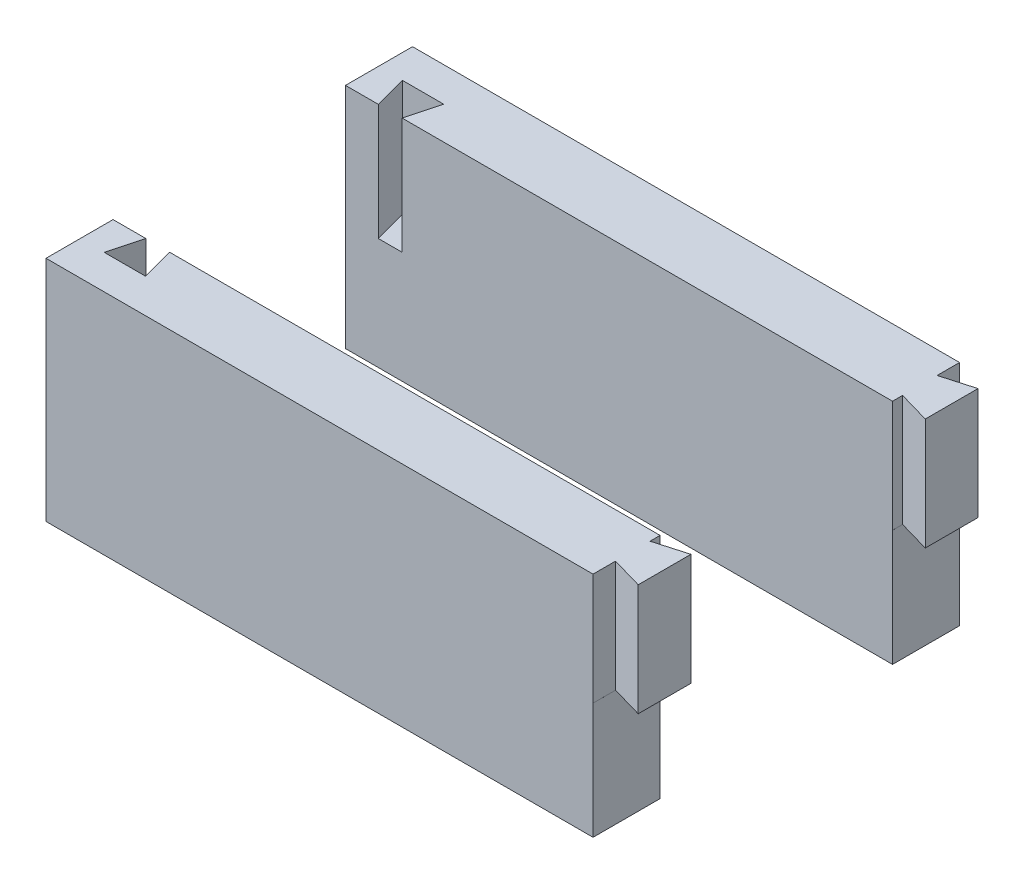
ISO-10303-21;
HEADER;
FILE_DESCRIPTION(('STEP AP214'),'2;1');
FILE_NAME('part.step','',(''),(''),'','','');
FILE_SCHEMA(('AUTOMOTIVE_DESIGN { 1 0 10303 214 1 1 1 1 }'));
ENDSEC;
DATA;
#1=APPLICATION_CONTEXT('core data for automotive mechanical design processes');
#2=APPLICATION_PROTOCOL_DEFINITION('international standard','automotive_design',2000,#1);
#3=PRODUCT_CONTEXT('',#1,'mechanical');
#4=PRODUCT('Part','Part','',(#3));
#5=PRODUCT_RELATED_PRODUCT_CATEGORY('part','',(#4));
#6=PRODUCT_DEFINITION_FORMATION('','',#4);
#7=PRODUCT_DEFINITION_CONTEXT('part definition',#1,'design');
#8=PRODUCT_DEFINITION('design','',#6,#7);
#9=PRODUCT_DEFINITION_SHAPE('','',#8);
#10=(LENGTH_UNIT() NAMED_UNIT(*) SI_UNIT(.MILLI.,.METRE.));
#11=(NAMED_UNIT(*) PLANE_ANGLE_UNIT() SI_UNIT($,.RADIAN.));
#12=(NAMED_UNIT(*) SI_UNIT($,.STERADIAN.) SOLID_ANGLE_UNIT());
#13=UNCERTAINTY_MEASURE_WITH_UNIT(LENGTH_MEASURE(1.E-05),#10,'distance_accuracy_value','');
#14=(GEOMETRIC_REPRESENTATION_CONTEXT(3) GLOBAL_UNCERTAINTY_ASSIGNED_CONTEXT((#13)) GLOBAL_UNIT_ASSIGNED_CONTEXT((#10,
#11,#12)) REPRESENTATION_CONTEXT('',''));
#15=CARTESIAN_POINT('',(0.,0.,0.));
#16=DIRECTION('',(0.,0.,1.));
#17=DIRECTION('',(1.,0.,0.));
#18=AXIS2_PLACEMENT_3D('',#15,#16,#17);
#19=CARTESIAN_POINT('',(-60.9366197183099,28.612676056338,-67.));
#20=DIRECTION('',(1.,0.,0.));
#21=DIRECTION('',(0.,0.,1.));
#22=AXIS2_PLACEMENT_3D('',#19,#20,#21);
#23=PLANE('',#22);
#24=DIRECTION('',(0.,-1.,0.));
#25=VECTOR('',#24,1.);
#26=CARTESIAN_POINT('',(-60.9366197183099,28.612676056338,-52.));
#27=LINE('',#26,#25);
#28=CARTESIAN_POINT('',(-60.9366197183099,28.612676056338,-52.));
#29=VERTEX_POINT('',#28);
#30=CARTESIAN_POINT('',(-60.9366197183099,-22.387323943662,-52.));
#31=VERTEX_POINT('',#30);
#32=EDGE_CURVE('E285',#29,#31,#27,.T.);
#33=ORIENTED_EDGE('',*,*,#32,.F.);
#34=DIRECTION('',(0.,0.,1.));
#35=VECTOR('',#34,1.);
#36=CARTESIAN_POINT('',(-60.9366197183099,28.612676056338,-67.));
#37=LINE('',#36,#35);
#38=CARTESIAN_POINT('',(-60.9366197183099,28.612676056338,-67.));
#39=VERTEX_POINT('',#38);
#40=EDGE_CURVE('E301',#39,#29,#37,.T.);
#41=ORIENTED_EDGE('',*,*,#40,.F.);
#42=DIRECTION('',(0.,-1.,0.));
#43=VECTOR('',#42,1.);
#44=CARTESIAN_POINT('',(-60.9366197183099,28.612676056338,-67.));
#45=LINE('',#44,#43);
#46=CARTESIAN_POINT('',(-60.9366197183099,-22.387323943662,-67.));
#47=VERTEX_POINT('',#46);
#48=EDGE_CURVE('E289',#39,#47,#45,.T.);
#49=ORIENTED_EDGE('',*,*,#48,.T.);
#50=DIRECTION('',(0.,0.,1.));
#51=VECTOR('',#50,1.);
#52=CARTESIAN_POINT('',(-60.9366197183099,-22.387323943662,-67.));
#53=LINE('',#52,#51);
#54=EDGE_CURVE('E12',#47,#31,#53,.T.);
#55=ORIENTED_EDGE('',*,*,#54,.T.);
#56=EDGE_LOOP('',(#33,#41,#49,#55));
#57=FACE_BOUND('',#56,.T.);
#58=ADVANCED_FACE('F56',(#57),#23,.F.);
#59=CARTESIAN_POINT('',(-60.9366197183099,-22.387323943662,-67.));
#60=DIRECTION('',(0.,1.,0.));
#61=DIRECTION('',(0.,0.,-1.));
#62=AXIS2_PLACEMENT_3D('',#59,#60,#61);
#63=PLANE('',#62);
#64=DIRECTION('',(1.,0.,0.));
#65=VECTOR('',#64,1.);
#66=CARTESIAN_POINT('',(-60.9366197183099,-22.387323943662,-52.));
#67=LINE('',#66,#65);
#68=CARTESIAN_POINT('',(61.4533802816902,-22.387323943662,-52.));
#69=VERTEX_POINT('',#68);
#70=EDGE_CURVE('E181',#31,#69,#67,.T.);
#71=ORIENTED_EDGE('',*,*,#70,.F.);
#72=ORIENTED_EDGE('',*,*,#54,.F.);
#73=DIRECTION('',(1.,0.,0.));
#74=VECTOR('',#73,1.);
#75=CARTESIAN_POINT('',(-60.9366197183099,-22.387323943662,-67.));
#76=LINE('',#75,#74);
#77=CARTESIAN_POINT('',(61.4533802816902,-22.387323943662,-67.));
#78=VERTEX_POINT('',#77);
#79=EDGE_CURVE('E293',#47,#78,#76,.T.);
#80=ORIENTED_EDGE('',*,*,#79,.T.);
#81=DIRECTION('',(0.,0.,1.));
#82=VECTOR('',#81,1.);
#83=CARTESIAN_POINT('',(61.4533802816902,-22.387323943662,-52.));
#84=LINE('',#83,#82);
#85=EDGE_CURVE('E172',#78,#69,#84,.T.);
#86=ORIENTED_EDGE('',*,*,#85,.T.);
#87=EDGE_LOOP('',(#71,#72,#80,#86));
#88=FACE_BOUND('',#87,.T.);
#89=ADVANCED_FACE('F361',(#88),#63,.F.);
#90=CARTESIAN_POINT('',(68.5633802816901,28.612676056338,-67.));
#91=DIRECTION('',(-1.,0.,0.));
#92=DIRECTION('',(0.,0.,-1.));
#93=AXIS2_PLACEMENT_3D('',#90,#91,#92);
#94=PLANE('',#93);
#95=DIRECTION('',(0.,1.,0.));
#96=VECTOR('',#95,1.);
#97=CARTESIAN_POINT('',(68.5633802816901,3.61267605633802,-64.0102835669542));
#98=LINE('',#97,#96);
#99=CARTESIAN_POINT('',(68.5633802816901,3.61267605633802,-64.0102835669542));
#100=VERTEX_POINT('',#99);
#101=CARTESIAN_POINT('',(68.5633802816901,28.612676056338,-64.0102835669542));
#102=VERTEX_POINT('',#101);
#103=EDGE_CURVE('E217',#100,#102,#98,.T.);
#104=ORIENTED_EDGE('',*,*,#103,.T.);
#105=DIRECTION('',(0.,0.,1.));
#106=VECTOR('',#105,1.);
#107=CARTESIAN_POINT('',(68.5633802816901,28.612676056338,-67.));
#108=LINE('',#107,#106);
#109=CARTESIAN_POINT('',(68.5633802816901,28.612676056338,-52.2102835669542));
#110=VERTEX_POINT('',#109);
#111=EDGE_CURVE('E64',#102,#110,#108,.T.);
#112=ORIENTED_EDGE('',*,*,#111,.T.);
#113=DIRECTION('',(0.,1.,0.));
#114=VECTOR('',#113,1.);
#115=CARTESIAN_POINT('',(68.5633802816901,3.61267605633802,-52.2102835669542));
#116=LINE('',#115,#114);
#117=CARTESIAN_POINT('',(68.5633802816901,3.61267605633802,-52.2102835669542));
#118=VERTEX_POINT('',#117);
#119=EDGE_CURVE('E196',#118,#110,#116,.T.);
#120=ORIENTED_EDGE('',*,*,#119,.F.);
#121=DIRECTION('',(0.,0.,-1.));
#122=VECTOR('',#121,1.);
#123=CARTESIAN_POINT('',(68.5633802816901,3.61267605633802,-52.));
#124=LINE('',#123,#122);
#125=EDGE_CURVE('E184',#118,#100,#124,.T.);
#126=ORIENTED_EDGE('',*,*,#125,.T.);
#127=EDGE_LOOP('',(#104,#112,#120,#126));
#128=FACE_BOUND('',#127,.T.);
#129=ADVANCED_FACE('F317',(#128),#94,.F.);
#130=CARTESIAN_POINT('',(-60.9366197183099,28.612676056338,-67.));
#131=DIRECTION('',(0.,-1.,0.));
#132=DIRECTION('',(0.,0.,1.));
#133=AXIS2_PLACEMENT_3D('',#130,#131,#132);
#134=PLANE('',#133);
#135=DIRECTION('',(0.961261695938318,0.,0.275637355817002));
#136=VECTOR('',#135,1.);
#137=CARTESIAN_POINT('',(68.5633802816901,28.612676056338,-52.2102835669542));
#138=LINE('',#137,#136);
#139=CARTESIAN_POINT('',(61.4500437317466,28.612676056338,-54.25));
#140=VERTEX_POINT('',#139);
#141=EDGE_CURVE('E206',#140,#110,#138,.T.);
#142=ORIENTED_EDGE('',*,*,#141,.T.);
#143=ORIENTED_EDGE('',*,*,#111,.F.);
#144=DIRECTION('',(-0.961261695938318,0.,0.275637355817003));
#145=VECTOR('',#144,1.);
#146=CARTESIAN_POINT('',(61.4500437317466,28.612676056338,-61.9705671339084));
#147=LINE('',#146,#145);
#148=CARTESIAN_POINT('',(61.4500437317466,28.612676056338,-61.9705671339084));
#149=VERTEX_POINT('',#148);
#150=EDGE_CURVE('E207',#102,#149,#147,.T.);
#151=ORIENTED_EDGE('',*,*,#150,.T.);
#152=DIRECTION('',(0.,0.,-1.));
#153=VECTOR('',#152,1.);
#154=CARTESIAN_POINT('',(61.4500437317466,28.612676056338,-67.));
#155=LINE('',#154,#153);
#156=CARTESIAN_POINT('',(61.4500437317466,28.612676056338,-67.));
#157=VERTEX_POINT('',#156);
#158=EDGE_CURVE('E228',#149,#157,#155,.T.);
#159=ORIENTED_EDGE('',*,*,#158,.T.);
#160=DIRECTION('',(-1.,0.,0.));
#161=VECTOR('',#160,1.);
#162=CARTESIAN_POINT('',(-60.9366197183099,28.612676056338,-67.));
#163=LINE('',#162,#161);
#164=EDGE_CURVE('E298',#157,#39,#163,.T.);
#165=ORIENTED_EDGE('',*,*,#164,.T.);
#166=ORIENTED_EDGE('',*,*,#40,.T.);
#167=DIRECTION('',(-1.,0.,0.));
#168=VECTOR('',#167,1.);
#169=CARTESIAN_POINT('',(-60.9366197183099,28.612676056338,-52.));
#170=LINE('',#169,#168);
#171=CARTESIAN_POINT('',(-53.5866197183098,28.612676056338,-52.));
#172=VERTEX_POINT('',#171);
#173=EDGE_CURVE('E306',#172,#29,#170,.T.);
#174=ORIENTED_EDGE('',*,*,#173,.F.);
#175=DIRECTION('',(0.258819045102518,0.,0.965925826289069));
#176=VECTOR('',#175,1.);
#177=CARTESIAN_POINT('',(-53.5866197183098,28.612676056338,-52.));
#178=LINE('',#177,#176);
#179=CARTESIAN_POINT('',(-55.553644461089,28.612676056338,-59.3410362797969));
#180=VERTEX_POINT('',#179);
#181=EDGE_CURVE('E255',#180,#172,#178,.T.);
#182=ORIENTED_EDGE('',*,*,#181,.F.);
#183=DIRECTION('',(-1.,0.,0.));
#184=VECTOR('',#183,1.);
#185=CARTESIAN_POINT('',(-55.553644461089,28.612676056338,-59.3410362797969));
#186=LINE('',#185,#184);
#187=CARTESIAN_POINT('',(-46.3195949755307,28.612676056338,-59.3410362797969));
#188=VERTEX_POINT('',#187);
#189=EDGE_CURVE('E263',#188,#180,#186,.T.);
#190=ORIENTED_EDGE('',*,*,#189,.F.);
#191=DIRECTION('',(0.258819045102518,0.,-0.965925826289069));
#192=VECTOR('',#191,1.);
#193=CARTESIAN_POINT('',(-46.3195949755307,28.612676056338,-59.3410362797969));
#194=LINE('',#193,#192);
#195=CARTESIAN_POINT('',(-48.2866197183099,28.612676056338,-52.));
#196=VERTEX_POINT('',#195);
#197=EDGE_CURVE('E259',#196,#188,#194,.T.);
#198=ORIENTED_EDGE('',*,*,#197,.F.);
#199=CARTESIAN_POINT('',(61.4500437317466,28.612676056338,-52.));
#200=VERTEX_POINT('',#199);
#201=EDGE_CURVE('E294',#200,#196,#170,.T.);
#202=ORIENTED_EDGE('',*,*,#201,.F.);
#203=DIRECTION('',(0.,0.,-1.));
#204=VECTOR('',#203,1.);
#205=CARTESIAN_POINT('',(61.4500437317466,28.612676056338,-54.25));
#206=LINE('',#205,#204);
#207=EDGE_CURVE('E202',#200,#140,#206,.T.);
#208=ORIENTED_EDGE('',*,*,#207,.T.);
#209=EDGE_LOOP('',(#142,#143,#151,#159,#165,#166,#174,#182,#190,#198,#202,#208));
#210=FACE_BOUND('',#209,.T.);
#211=ADVANCED_FACE('F321',(#210),#134,.F.);
#212=CARTESIAN_POINT('',(0.,0.,-67.));
#213=DIRECTION('',(0.,0.,-1.));
#214=DIRECTION('',(1.,0.,0.));
#215=AXIS2_PLACEMENT_3D('',#212,#213,#214);
#216=PLANE('',#215);
#217=DIRECTION('',(0.,-1.,0.));
#218=VECTOR('',#217,1.);
#219=CARTESIAN_POINT('',(61.4533802816902,3.61267605633802,-67.));
#220=LINE('',#219,#218);
#221=CARTESIAN_POINT('',(61.4533802816902,3.61267605633802,-67.));
#222=VERTEX_POINT('',#221);
#223=EDGE_CURVE('E183',#222,#78,#220,.T.);
#224=ORIENTED_EDGE('',*,*,#223,.T.);
#225=ORIENTED_EDGE('',*,*,#79,.F.);
#226=ORIENTED_EDGE('',*,*,#48,.F.);
#227=ORIENTED_EDGE('',*,*,#164,.F.);
#228=DIRECTION('',(0.,1.,0.));
#229=VECTOR('',#228,1.);
#230=CARTESIAN_POINT('',(61.4500437317466,3.61267605633802,-67.));
#231=LINE('',#230,#229);
#232=CARTESIAN_POINT('',(61.4500437317466,3.61267605633802,-67.));
#233=VERTEX_POINT('',#232);
#234=EDGE_CURVE('E224',#233,#157,#231,.T.);
#235=ORIENTED_EDGE('',*,*,#234,.F.);
#236=DIRECTION('',(1.,0.,0.));
#237=VECTOR('',#236,1.);
#238=CARTESIAN_POINT('',(68.5633802816901,3.61267605633802,-67.));
#239=LINE('',#238,#237);
#240=EDGE_CURVE('E232',#233,#222,#239,.T.);
#241=ORIENTED_EDGE('',*,*,#240,.T.);
#242=EDGE_LOOP('',(#224,#225,#226,#227,#235,#241));
#243=FACE_BOUND('',#242,.T.);
#244=ADVANCED_FACE('F365',(#243),#216,.T.);
#245=CARTESIAN_POINT('',(0.,0.,-52.));
#246=DIRECTION('',(0.,0.,-1.));
#247=DIRECTION('',(1.,0.,0.));
#248=AXIS2_PLACEMENT_3D('',#245,#246,#247);
#249=PLANE('',#248);
#250=DIRECTION('',(-1.,0.,0.));
#251=VECTOR('',#250,1.);
#252=CARTESIAN_POINT('',(61.4500437317466,3.61267605633802,-52.));
#253=LINE('',#252,#251);
#254=CARTESIAN_POINT('',(61.4533802816902,3.61267605633802,-52.));
#255=VERTEX_POINT('',#254);
#256=CARTESIAN_POINT('',(61.4500437317466,3.61267605633802,-52.));
#257=VERTEX_POINT('',#256);
#258=EDGE_CURVE('E179',#255,#257,#253,.T.);
#259=ORIENTED_EDGE('',*,*,#258,.T.);
#260=DIRECTION('',(0.,1.,0.));
#261=VECTOR('',#260,1.);
#262=CARTESIAN_POINT('',(61.4500437317466,3.61267605633802,-52.));
#263=LINE('',#262,#261);
#264=EDGE_CURVE('E210',#257,#200,#263,.T.);
#265=ORIENTED_EDGE('',*,*,#264,.T.);
#266=ORIENTED_EDGE('',*,*,#201,.T.);
#267=DIRECTION('',(0.,-1.,0.));
#268=VECTOR('',#267,1.);
#269=CARTESIAN_POINT('',(-48.2866197183099,267.34593418408,-52.));
#270=LINE('',#269,#268);
#271=CARTESIAN_POINT('',(-48.2866197183099,2.61267605633802,-52.));
#272=VERTEX_POINT('',#271);
#273=EDGE_CURVE('E277',#196,#272,#270,.T.);
#274=ORIENTED_EDGE('',*,*,#273,.T.);
#275=DIRECTION('',(-1.,0.,0.));
#276=VECTOR('',#275,1.);
#277=CARTESIAN_POINT('',(-60.9366197183099,2.61267605633802,-52.));
#278=LINE('',#277,#276);
#279=CARTESIAN_POINT('',(-53.5866197183098,2.61267605633802,-52.));
#280=VERTEX_POINT('',#279);
#281=EDGE_CURVE('E213',#272,#280,#278,.T.);
#282=ORIENTED_EDGE('',*,*,#281,.T.);
#283=DIRECTION('',(0.,-1.,0.));
#284=VECTOR('',#283,1.);
#285=CARTESIAN_POINT('',(-53.5866197183098,267.34593418408,-52.));
#286=LINE('',#285,#284);
#287=EDGE_CURVE('E250',#172,#280,#286,.T.);
#288=ORIENTED_EDGE('',*,*,#287,.F.);
#289=ORIENTED_EDGE('',*,*,#173,.T.);
#290=ORIENTED_EDGE('',*,*,#32,.T.);
#291=ORIENTED_EDGE('',*,*,#70,.T.);
#292=DIRECTION('',(0.,-1.,0.));
#293=VECTOR('',#292,1.);
#294=CARTESIAN_POINT('',(61.4533802816902,3.61267605633802,-52.));
#295=LINE('',#294,#293);
#296=EDGE_CURVE('E167',#255,#69,#295,.T.);
#297=ORIENTED_EDGE('',*,*,#296,.F.);
#298=EDGE_LOOP('',(#259,#265,#266,#274,#282,#288,#289,#290,#291,#297));
#299=FACE_BOUND('',#298,.T.);
#300=ADVANCED_FACE('F178',(#299),#249,.F.);
#301=CARTESIAN_POINT('',(-46.3195949755307,267.34593418408,-59.3410362797969));
#302=DIRECTION('',(-0.965925826289069,0.,-0.258819045102518));
#303=DIRECTION('',(0.258819045102518,0.,-0.965925826289069));
#304=AXIS2_PLACEMENT_3D('',#301,#302,#303);
#305=PLANE('',#304);
#306=ORIENTED_EDGE('',*,*,#197,.T.);
#307=DIRECTION('',(0.,-1.,0.));
#308=VECTOR('',#307,1.);
#309=CARTESIAN_POINT('',(-46.3195949755307,267.34593418408,-59.3410362797969));
#310=LINE('',#309,#308);
#311=CARTESIAN_POINT('',(-46.3195949755307,2.61267605633802,-59.3410362797969));
#312=VERTEX_POINT('',#311);
#313=EDGE_CURVE('E281',#188,#312,#310,.T.);
#314=ORIENTED_EDGE('',*,*,#313,.T.);
#315=DIRECTION('',(0.258819045102518,0.,-0.965925826289069));
#316=VECTOR('',#315,1.);
#317=CARTESIAN_POINT('',(-46.3195949755307,2.61267605633803,-59.3410362797969));
#318=LINE('',#317,#316);
#319=EDGE_CURVE('E246',#272,#312,#318,.T.);
#320=ORIENTED_EDGE('',*,*,#319,.F.);
#321=ORIENTED_EDGE('',*,*,#273,.F.);
#322=EDGE_LOOP('',(#306,#314,#320,#321));
#323=FACE_BOUND('',#322,.T.);
#324=ADVANCED_FACE('F346',(#323),#305,.T.);
#325=CARTESIAN_POINT('',(-55.553644461089,267.34593418408,-59.3410362797969));
#326=DIRECTION('',(0.,0.,1.));
#327=DIRECTION('',(-1.,0.,0.));
#328=AXIS2_PLACEMENT_3D('',#325,#326,#327);
#329=PLANE('',#328);
#330=ORIENTED_EDGE('',*,*,#189,.T.);
#331=DIRECTION('',(0.,-1.,0.));
#332=VECTOR('',#331,1.);
#333=CARTESIAN_POINT('',(-55.553644461089,267.34593418408,-59.3410362797969));
#334=LINE('',#333,#332);
#335=CARTESIAN_POINT('',(-55.553644461089,2.61267605633802,-59.3410362797969));
#336=VERTEX_POINT('',#335);
#337=EDGE_CURVE('E273',#180,#336,#334,.T.);
#338=ORIENTED_EDGE('',*,*,#337,.T.);
#339=DIRECTION('',(-1.,0.,0.));
#340=VECTOR('',#339,1.);
#341=CARTESIAN_POINT('',(-55.553644461089,2.61267605633803,-59.3410362797969));
#342=LINE('',#341,#340);
#343=EDGE_CURVE('E251',#312,#336,#342,.T.);
#344=ORIENTED_EDGE('',*,*,#343,.F.);
#345=ORIENTED_EDGE('',*,*,#313,.F.);
#346=EDGE_LOOP('',(#330,#338,#344,#345));
#347=FACE_BOUND('',#346,.T.);
#348=ADVANCED_FACE('F401',(#347),#329,.T.);
#349=CARTESIAN_POINT('',(-53.5866197183098,267.34593418408,-52.));
#350=DIRECTION('',(0.965925826289069,0.,-0.258819045102518));
#351=DIRECTION('',(0.258819045102518,0.,0.965925826289069));
#352=AXIS2_PLACEMENT_3D('',#349,#350,#351);
#353=PLANE('',#352);
#354=ORIENTED_EDGE('',*,*,#181,.T.);
#355=ORIENTED_EDGE('',*,*,#287,.T.);
#356=DIRECTION('',(0.258819045102518,0.,0.965925826289069));
#357=VECTOR('',#356,1.);
#358=CARTESIAN_POINT('',(-53.5866197183098,2.61267605633803,-52.));
#359=LINE('',#358,#357);
#360=EDGE_CURVE('E252',#336,#280,#359,.T.);
#361=ORIENTED_EDGE('',*,*,#360,.F.);
#362=ORIENTED_EDGE('',*,*,#337,.F.);
#363=EDGE_LOOP('',(#354,#355,#361,#362));
#364=FACE_BOUND('',#363,.T.);
#365=ADVANCED_FACE('F352',(#364),#353,.T.);
#366=CARTESIAN_POINT('',(-60.9366197183099,2.61267605633802,-67.));
#367=DIRECTION('',(0.,-1.,0.));
#368=DIRECTION('',(0.,0.,1.));
#369=AXIS2_PLACEMENT_3D('',#366,#367,#368);
#370=PLANE('',#369);
#371=ORIENTED_EDGE('',*,*,#281,.F.);
#372=ORIENTED_EDGE('',*,*,#319,.T.);
#373=ORIENTED_EDGE('',*,*,#343,.T.);
#374=ORIENTED_EDGE('',*,*,#360,.T.);
#375=EDGE_LOOP('',(#371,#372,#373,#374));
#376=FACE_BOUND('',#375,.T.);
#377=ADVANCED_FACE('F349',(#376),#370,.F.);
#378=CARTESIAN_POINT('',(61.4500437317466,3.61267605633802,-54.25));
#379=DIRECTION('',(-1.,0.,0.));
#380=DIRECTION('',(0.,0.,-1.));
#381=AXIS2_PLACEMENT_3D('',#378,#379,#380);
#382=PLANE('',#381);
#383=ORIENTED_EDGE('',*,*,#207,.F.);
#384=ORIENTED_EDGE('',*,*,#264,.F.);
#385=DIRECTION('',(0.,0.,-1.));
#386=VECTOR('',#385,1.);
#387=CARTESIAN_POINT('',(61.4500437317466,3.61267605633802,-54.25));
#388=LINE('',#387,#386);
#389=CARTESIAN_POINT('',(61.4500437317466,3.61267605633802,-54.25));
#390=VERTEX_POINT('',#389);
#391=EDGE_CURVE('E188',#257,#390,#388,.T.);
#392=ORIENTED_EDGE('',*,*,#391,.T.);
#393=DIRECTION('',(0.,1.,0.));
#394=VECTOR('',#393,1.);
#395=CARTESIAN_POINT('',(61.4500437317466,3.61267605633802,-54.25));
#396=LINE('',#395,#394);
#397=EDGE_CURVE('E191',#390,#140,#396,.T.);
#398=ORIENTED_EDGE('',*,*,#397,.T.);
#399=EDGE_LOOP('',(#383,#384,#392,#398));
#400=FACE_BOUND('',#399,.T.);
#401=ADVANCED_FACE('F341',(#400),#382,.F.);
#402=CARTESIAN_POINT('',(68.5633802816901,3.61267605633802,-52.2102835669542));
#403=DIRECTION('',(0.275637355817002,0.,-0.961261695938318));
#404=DIRECTION('',(0.961261695938318,0.,0.275637355817002));
#405=AXIS2_PLACEMENT_3D('',#402,#403,#404);
#406=PLANE('',#405);
#407=ORIENTED_EDGE('',*,*,#141,.F.);
#408=ORIENTED_EDGE('',*,*,#397,.F.);
#409=DIRECTION('',(0.961261695938318,0.,0.275637355817002));
#410=VECTOR('',#409,1.);
#411=CARTESIAN_POINT('',(68.5633802816901,3.61267605633802,-52.2102835669542));
#412=LINE('',#411,#410);
#413=CARTESIAN_POINT('',(61.4533802816902,3.61267605633802,-54.2490432596993));
#414=VERTEX_POINT('',#413);
#415=EDGE_CURVE('E192',#390,#414,#412,.T.);
#416=ORIENTED_EDGE('',*,*,#415,.T.);
#417=DIRECTION('',(-0.961261695938318,0.,-0.275637355817002));
#418=VECTOR('',#417,1.);
#419=CARTESIAN_POINT('',(68.5633802816901,3.61267605633802,-52.2102835669542));
#420=LINE('',#419,#418);
#421=EDGE_CURVE('E227',#118,#414,#420,.T.);
#422=ORIENTED_EDGE('',*,*,#421,.F.);
#423=ORIENTED_EDGE('',*,*,#119,.T.);
#424=EDGE_LOOP('',(#407,#408,#416,#422,#423));
#425=FACE_BOUND('',#424,.T.);
#426=ADVANCED_FACE('F327',(#425),#406,.F.);
#427=CARTESIAN_POINT('',(0.,3.61267605633802,-52.));
#428=DIRECTION('',(0.,-1.,0.));
#429=DIRECTION('',(0.,0.,1.));
#430=AXIS2_PLACEMENT_3D('',#427,#428,#429);
#431=PLANE('',#430);
#432=ORIENTED_EDGE('',*,*,#415,.F.);
#433=ORIENTED_EDGE('',*,*,#391,.F.);
#434=ORIENTED_EDGE('',*,*,#258,.F.);
#435=DIRECTION('',(0.,0.,1.));
#436=VECTOR('',#435,1.);
#437=CARTESIAN_POINT('',(61.4533802816902,3.61267605633802,-52.));
#438=LINE('',#437,#436);
#439=EDGE_CURVE('E163',#414,#255,#438,.T.);
#440=ORIENTED_EDGE('',*,*,#439,.F.);
#441=EDGE_LOOP('',(#432,#433,#434,#440));
#442=FACE_BOUND('',#441,.T.);
#443=ADVANCED_FACE('F186',(#442),#431,.F.);
#444=CARTESIAN_POINT('',(61.4500437317466,3.61267605633802,-67.));
#445=DIRECTION('',(-1.,0.,0.));
#446=DIRECTION('',(0.,0.,-1.));
#447=AXIS2_PLACEMENT_3D('',#444,#445,#446);
#448=PLANE('',#447);
#449=ORIENTED_EDGE('',*,*,#158,.F.);
#450=DIRECTION('',(0.,1.,0.));
#451=VECTOR('',#450,1.);
#452=CARTESIAN_POINT('',(61.4500437317466,3.61267605633802,-61.9705671339084));
#453=LINE('',#452,#451);
#454=CARTESIAN_POINT('',(61.4500437317466,3.61267605633802,-61.9705671339084));
#455=VERTEX_POINT('',#454);
#456=EDGE_CURVE('E221',#455,#149,#453,.T.);
#457=ORIENTED_EDGE('',*,*,#456,.F.);
#458=DIRECTION('',(0.,0.,-1.));
#459=VECTOR('',#458,1.);
#460=CARTESIAN_POINT('',(61.4500437317466,3.61267605633802,-67.));
#461=LINE('',#460,#459);
#462=EDGE_CURVE('E79',#455,#233,#461,.T.);
#463=ORIENTED_EDGE('',*,*,#462,.T.);
#464=ORIENTED_EDGE('',*,*,#234,.T.);
#465=EDGE_LOOP('',(#449,#457,#463,#464));
#466=FACE_BOUND('',#465,.T.);
#467=ADVANCED_FACE('F373',(#466),#448,.F.);
#468=CARTESIAN_POINT('',(61.4500437317466,3.61267605633802,-61.9705671339084));
#469=DIRECTION('',(0.275637355817003,0.,0.961261695938318));
#470=DIRECTION('',(-0.961261695938318,0.,0.275637355817003));
#471=AXIS2_PLACEMENT_3D('',#468,#469,#470);
#472=PLANE('',#471);
#473=ORIENTED_EDGE('',*,*,#150,.F.);
#474=ORIENTED_EDGE('',*,*,#103,.F.);
#475=DIRECTION('',(-0.961261695938318,0.,0.275637355817003));
#476=VECTOR('',#475,1.);
#477=CARTESIAN_POINT('',(61.4500437317466,3.61267605633802,-61.9705671339084));
#478=LINE('',#477,#476);
#479=CARTESIAN_POINT('',(61.4533802816902,3.61267605633802,-61.971523874209));
#480=VERTEX_POINT('',#479);
#481=EDGE_CURVE('E239',#100,#480,#478,.T.);
#482=ORIENTED_EDGE('',*,*,#481,.T.);
#483=EDGE_CURVE('E238',#480,#455,#478,.T.);
#484=ORIENTED_EDGE('',*,*,#483,.T.);
#485=ORIENTED_EDGE('',*,*,#456,.T.);
#486=EDGE_LOOP('',(#473,#474,#482,#484,#485));
#487=FACE_BOUND('',#486,.T.);
#488=ADVANCED_FACE('F371',(#487),#472,.F.);
#489=CARTESIAN_POINT('',(0.,3.61267605633802,-52.));
#490=DIRECTION('',(0.,-1.,0.));
#491=DIRECTION('',(0.,0.,1.));
#492=AXIS2_PLACEMENT_3D('',#489,#490,#491);
#493=PLANE('',#492);
#494=ORIENTED_EDGE('',*,*,#240,.F.);
#495=ORIENTED_EDGE('',*,*,#462,.F.);
#496=ORIENTED_EDGE('',*,*,#483,.F.);
#497=EDGE_CURVE('E174',#222,#480,#438,.T.);
#498=ORIENTED_EDGE('',*,*,#497,.F.);
#499=EDGE_LOOP('',(#494,#495,#496,#498));
#500=FACE_BOUND('',#499,.T.);
#501=ADVANCED_FACE('F368',(#500),#493,.F.);
#502=CARTESIAN_POINT('',(0.,3.61267605633802,-52.));
#503=DIRECTION('',(0.,1.,0.));
#504=DIRECTION('',(0.,0.,-1.));
#505=AXIS2_PLACEMENT_3D('',#502,#503,#504);
#506=PLANE('',#505);
#507=ORIENTED_EDGE('',*,*,#125,.F.);
#508=ORIENTED_EDGE('',*,*,#421,.T.);
#509=EDGE_CURVE('E71',#480,#414,#438,.T.);
#510=ORIENTED_EDGE('',*,*,#509,.F.);
#511=ORIENTED_EDGE('',*,*,#481,.F.);
#512=EDGE_LOOP('',(#507,#508,#510,#511));
#513=FACE_BOUND('',#512,.T.);
#514=ADVANCED_FACE('F331',(#513),#506,.F.);
#515=CARTESIAN_POINT('',(61.4533802816902,3.61267605633802,-52.));
#516=DIRECTION('',(-1.,0.,0.));
#517=DIRECTION('',(0.,0.,-1.));
#518=AXIS2_PLACEMENT_3D('',#515,#516,#517);
#519=PLANE('',#518);
#520=ORIENTED_EDGE('',*,*,#85,.F.);
#521=ORIENTED_EDGE('',*,*,#223,.F.);
#522=ORIENTED_EDGE('',*,*,#497,.T.);
#523=ORIENTED_EDGE('',*,*,#509,.T.);
#524=ORIENTED_EDGE('',*,*,#439,.T.);
#525=ORIENTED_EDGE('',*,*,#296,.T.);
#526=EDGE_LOOP('',(#520,#521,#522,#523,#524,#525));
#527=FACE_BOUND('',#526,.T.);
#528=ADVANCED_FACE('F166',(#527),#519,.F.);
#529=CLOSED_SHELL('',(#58,#89,#129,#211,#244,#300,#324,#348,#365,#377,#401,#426,#443,#467,#488,
#501,#514,#528));
#530=MANIFOLD_SOLID_BREP('B2_NOT_SHOWN',#529);
#531=CARTESIAN_POINT('',(-60.9366197183099,28.612676056338,15.));
#532=DIRECTION('',(1.,0.,0.));
#533=DIRECTION('',(0.,0.,-1.));
#534=AXIS2_PLACEMENT_3D('',#531,#532,#533);
#535=PLANE('',#534);
#536=DIRECTION('',(0.,-1.,0.));
#537=VECTOR('',#536,1.);
#538=CARTESIAN_POINT('',(-60.9366197183099,28.612676056338,0.));
#539=LINE('',#538,#537);
#540=CARTESIAN_POINT('',(-60.9366197183099,28.612676056338,0.));
#541=VERTEX_POINT('',#540);
#542=CARTESIAN_POINT('',(-60.9366197183099,-22.387323943662,0.));
#543=VERTEX_POINT('',#542);
#544=EDGE_CURVE('E755',#541,#543,#539,.T.);
#545=ORIENTED_EDGE('',*,*,#544,.T.);
#546=DIRECTION('',(0.,0.,-1.));
#547=VECTOR('',#546,1.);
#548=CARTESIAN_POINT('',(-60.9366197183099,-22.387323943662,15.));
#549=LINE('',#548,#547);
#550=CARTESIAN_POINT('',(-60.9366197183099,-22.387323943662,15.));
#551=VERTEX_POINT('',#550);
#552=EDGE_CURVE('E54',#551,#543,#549,.T.);
#553=ORIENTED_EDGE('',*,*,#552,.F.);
#554=DIRECTION('',(0.,-1.,0.));
#555=VECTOR('',#554,1.);
#556=CARTESIAN_POINT('',(-60.9366197183099,28.612676056338,15.));
#557=LINE('',#556,#555);
#558=CARTESIAN_POINT('',(-60.9366197183099,28.612676056338,15.));
#559=VERTEX_POINT('',#558);
#560=EDGE_CURVE('E757',#559,#551,#557,.T.);
#561=ORIENTED_EDGE('',*,*,#560,.F.);
#562=DIRECTION('',(0.,0.,-1.));
#563=VECTOR('',#562,1.);
#564=CARTESIAN_POINT('',(-60.9366197183099,28.612676056338,15.));
#565=LINE('',#564,#563);
#566=EDGE_CURVE('E766',#559,#541,#565,.T.);
#567=ORIENTED_EDGE('',*,*,#566,.T.);
#568=EDGE_LOOP('',(#545,#553,#561,#567));
#569=FACE_BOUND('',#568,.T.);
#570=ADVANCED_FACE('F558',(#569),#535,.F.);
#571=CARTESIAN_POINT('',(-60.9366197183099,-22.387323943662,15.));
#572=DIRECTION('',(0.,1.,0.));
#573=DIRECTION('',(0.,0.,1.));
#574=AXIS2_PLACEMENT_3D('',#571,#572,#573);
#575=PLANE('',#574);
#576=DIRECTION('',(1.,0.,0.));
#577=VECTOR('',#576,1.);
#578=CARTESIAN_POINT('',(-60.9366197183099,-22.387323943662,0.));
#579=LINE('',#578,#577);
#580=CARTESIAN_POINT('',(61.4533802816902,-22.387323943662,0.));
#581=VERTEX_POINT('',#580);
#582=EDGE_CURVE('E768',#543,#581,#579,.T.);
#583=ORIENTED_EDGE('',*,*,#582,.T.);
#584=DIRECTION('',(0.,0.,-1.));
#585=VECTOR('',#584,1.);
#586=CARTESIAN_POINT('',(61.4533802816902,-22.387323943662,0.));
#587=LINE('',#586,#585);
#588=CARTESIAN_POINT('',(61.4533802816902,-22.387323943662,15.));
#589=VERTEX_POINT('',#588);
#590=EDGE_CURVE('E668',#589,#581,#587,.T.);
#591=ORIENTED_EDGE('',*,*,#590,.F.);
#592=DIRECTION('',(1.,0.,0.));
#593=VECTOR('',#592,1.);
#594=CARTESIAN_POINT('',(-60.9366197183099,-22.387323943662,15.));
#595=LINE('',#594,#593);
#596=EDGE_CURVE('E760',#551,#589,#595,.T.);
#597=ORIENTED_EDGE('',*,*,#596,.F.);
#598=ORIENTED_EDGE('',*,*,#552,.T.);
#599=EDGE_LOOP('',(#583,#591,#597,#598));
#600=FACE_BOUND('',#599,.T.);
#601=ADVANCED_FACE('F832',(#600),#575,.F.);
#602=CARTESIAN_POINT('',(68.5633802816901,28.612676056338,15.));
#603=DIRECTION('',(-1.,0.,0.));
#604=DIRECTION('',(0.,0.,1.));
#605=AXIS2_PLACEMENT_3D('',#602,#603,#604);
#606=PLANE('',#605);
#607=DIRECTION('',(0.,1.,0.));
#608=VECTOR('',#607,1.);
#609=CARTESIAN_POINT('',(68.5633802816901,3.61267605633802,12.0102835669542));
#610=LINE('',#609,#608);
#611=CARTESIAN_POINT('',(68.5633802816901,3.61267605633802,12.0102835669542));
#612=VERTEX_POINT('',#611);
#613=CARTESIAN_POINT('',(68.5633802816901,28.612676056338,12.0102835669542));
#614=VERTEX_POINT('',#613);
#615=EDGE_CURVE('E708',#612,#614,#610,.T.);
#616=ORIENTED_EDGE('',*,*,#615,.F.);
#617=DIRECTION('',(0.,0.,1.));
#618=VECTOR('',#617,1.);
#619=CARTESIAN_POINT('',(68.5633802816901,3.61267605633802,0.));
#620=LINE('',#619,#618);
#621=CARTESIAN_POINT('',(68.5633802816901,3.61267605633802,0.210283566954185));
#622=VERTEX_POINT('',#621);
#623=EDGE_CURVE('E674',#622,#612,#620,.T.);
#624=ORIENTED_EDGE('',*,*,#623,.F.);
#625=DIRECTION('',(0.,1.,0.));
#626=VECTOR('',#625,1.);
#627=CARTESIAN_POINT('',(68.5633802816901,3.61267605633802,0.210283566954185));
#628=LINE('',#627,#626);
#629=CARTESIAN_POINT('',(68.5633802816901,28.612676056338,0.210283566954185));
#630=VERTEX_POINT('',#629);
#631=EDGE_CURVE('E692',#622,#630,#628,.T.);
#632=ORIENTED_EDGE('',*,*,#631,.T.);
#633=DIRECTION('',(0.,0.,-1.));
#634=VECTOR('',#633,1.);
#635=CARTESIAN_POINT('',(68.5633802816901,28.612676056338,15.));
#636=LINE('',#635,#634);
#637=EDGE_CURVE('E565',#614,#630,#636,.T.);
#638=ORIENTED_EDGE('',*,*,#637,.F.);
#639=EDGE_LOOP('',(#616,#624,#632,#638));
#640=FACE_BOUND('',#639,.T.);
#641=ADVANCED_FACE('F783',(#640),#606,.F.);
#642=CARTESIAN_POINT('',(-60.9366197183099,28.612676056338,15.));
#643=DIRECTION('',(0.,-1.,0.));
#644=DIRECTION('',(0.,0.,-1.));
#645=AXIS2_PLACEMENT_3D('',#642,#643,#644);
#646=PLANE('',#645);
#647=DIRECTION('',(0.961261695938318,0.,-0.275637355817002));
#648=VECTOR('',#647,1.);
#649=CARTESIAN_POINT('',(68.5633802816901,28.612676056338,0.210283566954185));
#650=LINE('',#649,#648);
#651=CARTESIAN_POINT('',(61.4500437317466,28.612676056338,2.25));
#652=VERTEX_POINT('',#651);
#653=EDGE_CURVE('E701',#652,#630,#650,.T.);
#654=ORIENTED_EDGE('',*,*,#653,.F.);
#655=DIRECTION('',(0.,0.,1.));
#656=VECTOR('',#655,1.);
#657=CARTESIAN_POINT('',(61.4500437317466,28.612676056338,2.25));
#658=LINE('',#657,#656);
#659=CARTESIAN_POINT('',(61.4500437317466,28.612676056338,0.));
#660=VERTEX_POINT('',#659);
#661=EDGE_CURVE('E698',#660,#652,#658,.T.);
#662=ORIENTED_EDGE('',*,*,#661,.F.);
#663=DIRECTION('',(-1.,0.,0.));
#664=VECTOR('',#663,1.);
#665=CARTESIAN_POINT('',(-60.9366197183099,28.612676056338,0.));
#666=LINE('',#665,#664);
#667=CARTESIAN_POINT('',(-48.2866197183099,28.612676056338,0.));
#668=VERTEX_POINT('',#667);
#669=EDGE_CURVE('E761',#660,#668,#666,.T.);
#670=ORIENTED_EDGE('',*,*,#669,.T.);
#671=DIRECTION('',(0.258819045102518,0.,0.965925826289069));
#672=VECTOR('',#671,1.);
#673=CARTESIAN_POINT('',(-46.3195949755307,28.612676056338,7.34103627979693));
#674=LINE('',#673,#672);
#675=CARTESIAN_POINT('',(-46.3195949755307,28.612676056338,7.34103627979693));
#676=VERTEX_POINT('',#675);
#677=EDGE_CURVE('E737',#668,#676,#674,.T.);
#678=ORIENTED_EDGE('',*,*,#677,.T.);
#679=DIRECTION('',(-1.,0.,0.));
#680=VECTOR('',#679,1.);
#681=CARTESIAN_POINT('',(-55.553644461089,28.612676056338,7.34103627979693));
#682=LINE('',#681,#680);
#683=CARTESIAN_POINT('',(-55.553644461089,28.612676056338,7.34103627979693));
#684=VERTEX_POINT('',#683);
#685=EDGE_CURVE('E740',#676,#684,#682,.T.);
#686=ORIENTED_EDGE('',*,*,#685,.T.);
#687=DIRECTION('',(0.258819045102518,0.,-0.965925826289069));
#688=VECTOR('',#687,1.);
#689=CARTESIAN_POINT('',(-53.5866197183098,28.612676056338,0.));
#690=LINE('',#689,#688);
#691=CARTESIAN_POINT('',(-53.5866197183098,28.612676056338,0.));
#692=VERTEX_POINT('',#691);
#693=EDGE_CURVE('E734',#684,#692,#690,.T.);
#694=ORIENTED_EDGE('',*,*,#693,.T.);
#695=EDGE_CURVE('E770',#692,#541,#666,.T.);
#696=ORIENTED_EDGE('',*,*,#695,.T.);
#697=ORIENTED_EDGE('',*,*,#566,.F.);
#698=DIRECTION('',(-1.,0.,0.));
#699=VECTOR('',#698,1.);
#700=CARTESIAN_POINT('',(-60.9366197183099,28.612676056338,15.));
#701=LINE('',#700,#699);
#702=CARTESIAN_POINT('',(61.4500437317466,28.612676056338,15.));
#703=VERTEX_POINT('',#702);
#704=EDGE_CURVE('E764',#703,#559,#701,.T.);
#705=ORIENTED_EDGE('',*,*,#704,.F.);
#706=DIRECTION('',(0.,0.,1.));
#707=VECTOR('',#706,1.);
#708=CARTESIAN_POINT('',(61.4500437317466,28.612676056338,15.));
#709=LINE('',#708,#707);
#710=CARTESIAN_POINT('',(61.4500437317466,28.612676056338,9.97056713390836));
#711=VERTEX_POINT('',#710);
#712=EDGE_CURVE('E716',#711,#703,#709,.T.);
#713=ORIENTED_EDGE('',*,*,#712,.F.);
#714=DIRECTION('',(-0.961261695938318,0.,-0.275637355817003));
#715=VECTOR('',#714,1.);
#716=CARTESIAN_POINT('',(61.4500437317466,28.612676056338,9.97056713390836));
#717=LINE('',#716,#715);
#718=EDGE_CURVE('E702',#614,#711,#717,.T.);
#719=ORIENTED_EDGE('',*,*,#718,.F.);
#720=ORIENTED_EDGE('',*,*,#637,.T.);
#721=EDGE_LOOP('',(#654,#662,#670,#678,#686,#694,#696,#697,#705,#713,#719,#720));
#722=FACE_BOUND('',#721,.T.);
#723=ADVANCED_FACE('F778',(#722),#646,.F.);
#724=CARTESIAN_POINT('',(0.,0.,15.));
#725=DIRECTION('',(0.,0.,1.));
#726=DIRECTION('',(1.,0.,0.));
#727=AXIS2_PLACEMENT_3D('',#724,#725,#726);
#728=PLANE('',#727);
#729=DIRECTION('',(0.,-1.,0.));
#730=VECTOR('',#729,1.);
#731=CARTESIAN_POINT('',(61.4533802816902,3.61267605633802,15.));
#732=LINE('',#731,#730);
#733=CARTESIAN_POINT('',(61.4533802816902,3.61267605633802,15.));
#734=VERTEX_POINT('',#733);
#735=EDGE_CURVE('E673',#734,#589,#732,.T.);
#736=ORIENTED_EDGE('',*,*,#735,.F.);
#737=DIRECTION('',(1.,0.,0.));
#738=VECTOR('',#737,1.);
#739=CARTESIAN_POINT('',(68.5633802816901,3.61267605633802,15.));
#740=LINE('',#739,#738);
#741=CARTESIAN_POINT('',(61.4500437317466,3.61267605633802,15.));
#742=VERTEX_POINT('',#741);
#743=EDGE_CURVE('E718',#742,#734,#740,.T.);
#744=ORIENTED_EDGE('',*,*,#743,.F.);
#745=DIRECTION('',(0.,1.,0.));
#746=VECTOR('',#745,1.);
#747=CARTESIAN_POINT('',(61.4500437317466,3.61267605633802,15.));
#748=LINE('',#747,#746);
#749=EDGE_CURVE('E712',#742,#703,#748,.T.);
#750=ORIENTED_EDGE('',*,*,#749,.T.);
#751=ORIENTED_EDGE('',*,*,#704,.T.);
#752=ORIENTED_EDGE('',*,*,#560,.T.);
#753=ORIENTED_EDGE('',*,*,#596,.T.);
#754=EDGE_LOOP('',(#736,#744,#750,#751,#752,#753));
#755=FACE_BOUND('',#754,.T.);
#756=ADVANCED_FACE('F814',(#755),#728,.T.);
#757=CARTESIAN_POINT('',(0.,0.,0.));
#758=DIRECTION('',(0.,0.,1.));
#759=DIRECTION('',(1.,0.,0.));
#760=AXIS2_PLACEMENT_3D('',#757,#758,#759);
#761=PLANE('',#760);
#762=DIRECTION('',(-1.,0.,0.));
#763=VECTOR('',#762,1.);
#764=CARTESIAN_POINT('',(61.4500437317466,3.61267605633802,0.));
#765=LINE('',#764,#763);
#766=CARTESIAN_POINT('',(61.4533802816902,3.61267605633802,0.));
#767=VERTEX_POINT('',#766);
#768=CARTESIAN_POINT('',(61.4500437317466,3.61267605633802,0.));
#769=VERTEX_POINT('',#768);
#770=EDGE_CURVE('E680',#767,#769,#765,.T.);
#771=ORIENTED_EDGE('',*,*,#770,.F.);
#772=DIRECTION('',(0.,-1.,0.));
#773=VECTOR('',#772,1.);
#774=CARTESIAN_POINT('',(61.4533802816902,3.61267605633802,0.));
#775=LINE('',#774,#773);
#776=EDGE_CURVE('E663',#767,#581,#775,.T.);
#777=ORIENTED_EDGE('',*,*,#776,.T.);
#778=ORIENTED_EDGE('',*,*,#582,.F.);
#779=ORIENTED_EDGE('',*,*,#544,.F.);
#780=ORIENTED_EDGE('',*,*,#695,.F.);
#781=DIRECTION('',(0.,-1.,0.));
#782=VECTOR('',#781,1.);
#783=CARTESIAN_POINT('',(-53.5866197183098,267.34593418408,0.));
#784=LINE('',#783,#782);
#785=CARTESIAN_POINT('',(-53.5866197183098,2.61267605633802,0.));
#786=VERTEX_POINT('',#785);
#787=EDGE_CURVE('E729',#692,#786,#784,.T.);
#788=ORIENTED_EDGE('',*,*,#787,.T.);
#789=DIRECTION('',(-1.,0.,0.));
#790=VECTOR('',#789,1.);
#791=CARTESIAN_POINT('',(-60.9366197183099,2.61267605633802,0.));
#792=LINE('',#791,#790);
#793=CARTESIAN_POINT('',(-48.2866197183099,2.61267605633802,0.));
#794=VERTEX_POINT('',#793);
#795=EDGE_CURVE('E705',#794,#786,#792,.T.);
#796=ORIENTED_EDGE('',*,*,#795,.F.);
#797=DIRECTION('',(0.,-1.,0.));
#798=VECTOR('',#797,1.);
#799=CARTESIAN_POINT('',(-48.2866197183099,267.34593418408,0.));
#800=LINE('',#799,#798);
#801=EDGE_CURVE('E750',#668,#794,#800,.T.);
#802=ORIENTED_EDGE('',*,*,#801,.F.);
#803=ORIENTED_EDGE('',*,*,#669,.F.);
#804=DIRECTION('',(0.,1.,0.));
#805=VECTOR('',#804,1.);
#806=CARTESIAN_POINT('',(61.4500437317466,3.61267605633802,0.));
#807=LINE('',#806,#805);
#808=EDGE_CURVE('E689',#769,#660,#807,.T.);
#809=ORIENTED_EDGE('',*,*,#808,.F.);
#810=EDGE_LOOP('',(#771,#777,#778,#779,#780,#788,#796,#802,#803,#809));
#811=FACE_BOUND('',#810,.T.);
#812=ADVANCED_FACE('F687',(#811),#761,.F.);
#813=CARTESIAN_POINT('',(-46.3195949755307,267.34593418408,7.34103627979693));
#814=DIRECTION('',(-0.965925826289069,0.,0.258819045102518));
#815=DIRECTION('',(0.258819045102518,0.,0.965925826289069));
#816=AXIS2_PLACEMENT_3D('',#813,#814,#815);
#817=PLANE('',#816);
#818=ORIENTED_EDGE('',*,*,#677,.F.);
#819=ORIENTED_EDGE('',*,*,#801,.T.);
#820=DIRECTION('',(0.258819045102518,0.,0.965925826289069));
#821=VECTOR('',#820,1.);
#822=CARTESIAN_POINT('',(-46.3195949755307,2.61267605633803,7.34103627979693));
#823=LINE('',#822,#821);
#824=CARTESIAN_POINT('',(-46.3195949755307,2.61267605633802,7.34103627979693));
#825=VERTEX_POINT('',#824);
#826=EDGE_CURVE('E726',#794,#825,#823,.T.);
#827=ORIENTED_EDGE('',*,*,#826,.T.);
#828=DIRECTION('',(0.,-1.,0.));
#829=VECTOR('',#828,1.);
#830=CARTESIAN_POINT('',(-46.3195949755307,267.34593418408,7.34103627979693));
#831=LINE('',#830,#829);
#832=EDGE_CURVE('E752',#676,#825,#831,.T.);
#833=ORIENTED_EDGE('',*,*,#832,.F.);
#834=EDGE_LOOP('',(#818,#819,#827,#833));
#835=FACE_BOUND('',#834,.T.);
#836=ADVANCED_FACE('F796',(#835),#817,.T.);
#837=CARTESIAN_POINT('',(-55.553644461089,267.34593418408,7.34103627979693));
#838=DIRECTION('',(0.,0.,-1.));
#839=DIRECTION('',(-1.,0.,0.));
#840=AXIS2_PLACEMENT_3D('',#837,#838,#839);
#841=PLANE('',#840);
#842=ORIENTED_EDGE('',*,*,#685,.F.);
#843=ORIENTED_EDGE('',*,*,#832,.T.);
#844=DIRECTION('',(-1.,0.,0.));
#845=VECTOR('',#844,1.);
#846=CARTESIAN_POINT('',(-55.553644461089,2.61267605633803,7.34103627979693));
#847=LINE('',#846,#845);
#848=CARTESIAN_POINT('',(-55.553644461089,2.61267605633802,7.34103627979693));
#849=VERTEX_POINT('',#848);
#850=EDGE_CURVE('E730',#825,#849,#847,.T.);
#851=ORIENTED_EDGE('',*,*,#850,.T.);
#852=DIRECTION('',(0.,-1.,0.));
#853=VECTOR('',#852,1.);
#854=CARTESIAN_POINT('',(-55.553644461089,267.34593418408,7.34103627979693));
#855=LINE('',#854,#853);
#856=EDGE_CURVE('E747',#684,#849,#855,.T.);
#857=ORIENTED_EDGE('',*,*,#856,.F.);
#858=EDGE_LOOP('',(#842,#843,#851,#857));
#859=FACE_BOUND('',#858,.T.);
#860=ADVANCED_FACE('F802',(#859),#841,.T.);
#861=CARTESIAN_POINT('',(-53.5866197183098,267.34593418408,0.));
#862=DIRECTION('',(0.965925826289069,0.,0.258819045102518));
#863=DIRECTION('',(0.258819045102518,0.,-0.965925826289069));
#864=AXIS2_PLACEMENT_3D('',#861,#862,#863);
#865=PLANE('',#864);
#866=ORIENTED_EDGE('',*,*,#693,.F.);
#867=ORIENTED_EDGE('',*,*,#856,.T.);
#868=DIRECTION('',(0.258819045102518,0.,-0.965925826289069));
#869=VECTOR('',#868,1.);
#870=CARTESIAN_POINT('',(-53.5866197183098,2.61267605633803,0.));
#871=LINE('',#870,#869);
#872=EDGE_CURVE('E731',#849,#786,#871,.T.);
#873=ORIENTED_EDGE('',*,*,#872,.T.);
#874=ORIENTED_EDGE('',*,*,#787,.F.);
#875=EDGE_LOOP('',(#866,#867,#873,#874));
#876=FACE_BOUND('',#875,.T.);
#877=ADVANCED_FACE('F804',(#876),#865,.T.);
#878=CARTESIAN_POINT('',(-60.9366197183099,2.61267605633802,15.));
#879=DIRECTION('',(0.,-1.,0.));
#880=DIRECTION('',(0.,0.,-1.));
#881=AXIS2_PLACEMENT_3D('',#878,#879,#880);
#882=PLANE('',#881);
#883=ORIENTED_EDGE('',*,*,#795,.T.);
#884=ORIENTED_EDGE('',*,*,#872,.F.);
#885=ORIENTED_EDGE('',*,*,#850,.F.);
#886=ORIENTED_EDGE('',*,*,#826,.F.);
#887=EDGE_LOOP('',(#883,#884,#885,#886));
#888=FACE_BOUND('',#887,.T.);
#889=ADVANCED_FACE('F799',(#888),#882,.F.);
#890=CARTESIAN_POINT('',(61.4500437317466,3.61267605633802,2.25));
#891=DIRECTION('',(-1.,0.,0.));
#892=DIRECTION('',(0.,0.,1.));
#893=AXIS2_PLACEMENT_3D('',#890,#891,#892);
#894=PLANE('',#893);
#895=ORIENTED_EDGE('',*,*,#661,.T.);
#896=DIRECTION('',(0.,1.,0.));
#897=VECTOR('',#896,1.);
#898=CARTESIAN_POINT('',(61.4500437317466,3.61267605633802,2.25));
#899=LINE('',#898,#897);
#900=CARTESIAN_POINT('',(61.4500437317466,3.61267605633802,2.25));
#901=VERTEX_POINT('',#900);
#902=EDGE_CURVE('E690',#901,#652,#899,.T.);
#903=ORIENTED_EDGE('',*,*,#902,.F.);
#904=DIRECTION('',(0.,0.,1.));
#905=VECTOR('',#904,1.);
#906=CARTESIAN_POINT('',(61.4500437317466,3.61267605633802,2.25));
#907=LINE('',#906,#905);
#908=EDGE_CURVE('E694',#769,#901,#907,.T.);
#909=ORIENTED_EDGE('',*,*,#908,.F.);
#910=ORIENTED_EDGE('',*,*,#808,.T.);
#911=EDGE_LOOP('',(#895,#903,#909,#910));
#912=FACE_BOUND('',#911,.T.);
#913=ADVANCED_FACE('F790',(#912),#894,.F.);
#914=CARTESIAN_POINT('',(68.5633802816901,3.61267605633802,0.210283566954185));
#915=DIRECTION('',(0.275637355817002,0.,0.961261695938318));
#916=DIRECTION('',(0.961261695938318,0.,-0.275637355817002));
#917=AXIS2_PLACEMENT_3D('',#914,#915,#916);
#918=PLANE('',#917);
#919=ORIENTED_EDGE('',*,*,#653,.T.);
#920=ORIENTED_EDGE('',*,*,#631,.F.);
#921=DIRECTION('',(-0.961261695938318,0.,0.275637355817002));
#922=VECTOR('',#921,1.);
#923=CARTESIAN_POINT('',(68.5633802816901,3.61267605633802,0.210283566954185));
#924=LINE('',#923,#922);
#925=CARTESIAN_POINT('',(61.4533802816902,3.61267605633802,2.24904325969933));
#926=VERTEX_POINT('',#925);
#927=EDGE_CURVE('E715',#622,#926,#924,.T.);
#928=ORIENTED_EDGE('',*,*,#927,.T.);
#929=DIRECTION('',(0.961261695938318,0.,-0.275637355817002));
#930=VECTOR('',#929,1.);
#931=CARTESIAN_POINT('',(68.5633802816901,3.61267605633802,0.210283566954185));
#932=LINE('',#931,#930);
#933=EDGE_CURVE('E683',#901,#926,#932,.T.);
#934=ORIENTED_EDGE('',*,*,#933,.F.);
#935=ORIENTED_EDGE('',*,*,#902,.T.);
#936=EDGE_LOOP('',(#919,#920,#928,#934,#935));
#937=FACE_BOUND('',#936,.T.);
#938=ADVANCED_FACE('F788',(#937),#918,.F.);
#939=CARTESIAN_POINT('',(0.,3.61267605633802,0.));
#940=DIRECTION('',(0.,-1.,0.));
#941=DIRECTION('',(0.,0.,-1.));
#942=AXIS2_PLACEMENT_3D('',#939,#940,#941);
#943=PLANE('',#942);
#944=ORIENTED_EDGE('',*,*,#933,.T.);
#945=DIRECTION('',(0.,0.,-1.));
#946=VECTOR('',#945,1.);
#947=CARTESIAN_POINT('',(61.4533802816902,3.61267605633802,0.));
#948=LINE('',#947,#946);
#949=EDGE_CURVE('E666',#926,#767,#948,.T.);
#950=ORIENTED_EDGE('',*,*,#949,.T.);
#951=ORIENTED_EDGE('',*,*,#770,.T.);
#952=ORIENTED_EDGE('',*,*,#908,.T.);
#953=EDGE_LOOP('',(#944,#950,#951,#952));
#954=FACE_BOUND('',#953,.T.);
#955=ADVANCED_FACE('F678',(#954),#943,.F.);
#956=CARTESIAN_POINT('',(61.4500437317466,3.61267605633802,15.));
#957=DIRECTION('',(-1.,0.,0.));
#958=DIRECTION('',(0.,0.,1.));
#959=AXIS2_PLACEMENT_3D('',#956,#957,#958);
#960=PLANE('',#959);
#961=ORIENTED_EDGE('',*,*,#712,.T.);
#962=ORIENTED_EDGE('',*,*,#749,.F.);
#963=DIRECTION('',(0.,0.,1.));
#964=VECTOR('',#963,1.);
#965=CARTESIAN_POINT('',(61.4500437317466,3.61267605633802,15.));
#966=LINE('',#965,#964);
#967=CARTESIAN_POINT('',(61.4500437317466,3.61267605633802,9.97056713390836));
#968=VERTEX_POINT('',#967);
#969=EDGE_CURVE('E580',#968,#742,#966,.T.);
#970=ORIENTED_EDGE('',*,*,#969,.F.);
#971=DIRECTION('',(0.,1.,0.));
#972=VECTOR('',#971,1.);
#973=CARTESIAN_POINT('',(61.4500437317466,3.61267605633802,9.97056713390836));
#974=LINE('',#973,#972);
#975=EDGE_CURVE('E710',#968,#711,#974,.T.);
#976=ORIENTED_EDGE('',*,*,#975,.T.);
#977=EDGE_LOOP('',(#961,#962,#970,#976));
#978=FACE_BOUND('',#977,.T.);
#979=ADVANCED_FACE('F817',(#978),#960,.F.);
#980=CARTESIAN_POINT('',(61.4500437317466,3.61267605633802,9.97056713390836));
#981=DIRECTION('',(0.275637355817003,0.,-0.961261695938318));
#982=DIRECTION('',(-0.961261695938318,0.,-0.275637355817003));
#983=AXIS2_PLACEMENT_3D('',#980,#981,#982);
#984=PLANE('',#983);
#985=ORIENTED_EDGE('',*,*,#718,.T.);
#986=ORIENTED_EDGE('',*,*,#975,.F.);
#987=DIRECTION('',(-0.961261695938318,0.,-0.275637355817003));
#988=VECTOR('',#987,1.);
#989=CARTESIAN_POINT('',(61.4500437317466,3.61267605633802,9.97056713390836));
#990=LINE('',#989,#988);
#991=CARTESIAN_POINT('',(61.4533802816902,3.61267605633802,9.97152387420903));
#992=VERTEX_POINT('',#991);
#993=EDGE_CURVE('E722',#992,#968,#990,.T.);
#994=ORIENTED_EDGE('',*,*,#993,.F.);
#995=EDGE_CURVE('E723',#612,#992,#990,.T.);
#996=ORIENTED_EDGE('',*,*,#995,.F.);
#997=ORIENTED_EDGE('',*,*,#615,.T.);
#998=EDGE_LOOP('',(#985,#986,#994,#996,#997));
#999=FACE_BOUND('',#998,.T.);
#1000=ADVANCED_FACE('F821',(#999),#984,.F.);
#1001=CARTESIAN_POINT('',(0.,3.61267605633802,0.));
#1002=DIRECTION('',(0.,-1.,0.));
#1003=DIRECTION('',(0.,0.,-1.));
#1004=AXIS2_PLACEMENT_3D('',#1001,#1002,#1003);
#1005=PLANE('',#1004);
#1006=ORIENTED_EDGE('',*,*,#743,.T.);
#1007=EDGE_CURVE('E685',#734,#992,#948,.T.);
#1008=ORIENTED_EDGE('',*,*,#1007,.T.);
#1009=ORIENTED_EDGE('',*,*,#993,.T.);
#1010=ORIENTED_EDGE('',*,*,#969,.T.);
#1011=EDGE_LOOP('',(#1006,#1008,#1009,#1010));
#1012=FACE_BOUND('',#1011,.T.);
#1013=ADVANCED_FACE('F826',(#1012),#1005,.F.);
#1014=CARTESIAN_POINT('',(0.,3.61267605633802,0.));
#1015=DIRECTION('',(0.,1.,0.));
#1016=DIRECTION('',(0.,0.,1.));
#1017=AXIS2_PLACEMENT_3D('',#1014,#1015,#1016);
#1018=PLANE('',#1017);
#1019=ORIENTED_EDGE('',*,*,#623,.T.);
#1020=ORIENTED_EDGE('',*,*,#995,.T.);
#1021=EDGE_CURVE('E572',#992,#926,#948,.T.);
#1022=ORIENTED_EDGE('',*,*,#1021,.T.);
#1023=ORIENTED_EDGE('',*,*,#927,.F.);
#1024=EDGE_LOOP('',(#1019,#1020,#1022,#1023));
#1025=FACE_BOUND('',#1024,.T.);
#1026=ADVANCED_FACE('F825',(#1025),#1018,.F.);
#1027=CARTESIAN_POINT('',(61.4533802816902,3.61267605633802,0.));
#1028=DIRECTION('',(-1.,0.,0.));
#1029=DIRECTION('',(0.,0.,1.));
#1030=AXIS2_PLACEMENT_3D('',#1027,#1028,#1029);
#1031=PLANE('',#1030);
#1032=ORIENTED_EDGE('',*,*,#590,.T.);
#1033=ORIENTED_EDGE('',*,*,#776,.F.);
#1034=ORIENTED_EDGE('',*,*,#949,.F.);
#1035=ORIENTED_EDGE('',*,*,#1021,.F.);
#1036=ORIENTED_EDGE('',*,*,#1007,.F.);
#1037=ORIENTED_EDGE('',*,*,#735,.T.);
#1038=EDGE_LOOP('',(#1032,#1033,#1034,#1035,#1036,#1037));
#1039=FACE_BOUND('',#1038,.T.);
#1040=ADVANCED_FACE('F665',(#1039),#1031,.F.);
#1041=CLOSED_SHELL('',(#570,#601,#641,#723,#756,#812,#836,#860,#877,#889,#913,#938,#955,#979,
#1000,#1013,#1026,#1040));
#1042=MANIFOLD_SOLID_BREP('B6',#1041);
#1043=ADVANCED_BREP_SHAPE_REPRESENTATION('',(#18,#530,#1042),#14);
#1044=SHAPE_DEFINITION_REPRESENTATION(#9,#1043);
ENDSEC;
END-ISO-10303-21;
